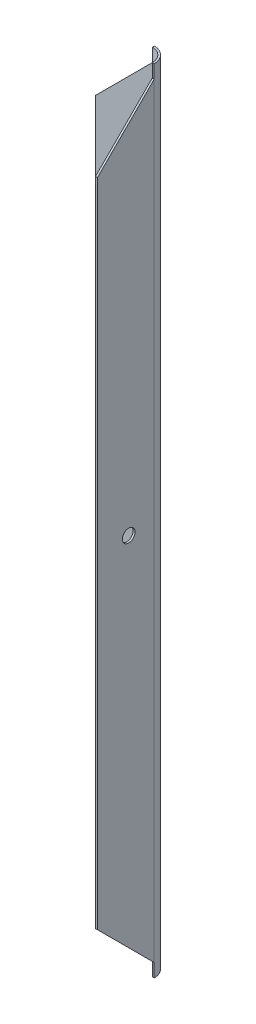
ISO-10303-21;
HEADER;
FILE_DESCRIPTION(('STEP AP214'),'2;1');
FILE_NAME('part.step','',(''),(''),'','','');
FILE_SCHEMA(('AUTOMOTIVE_DESIGN { 1 0 10303 214 1 1 1 1 }'));
ENDSEC;
DATA;
#1=APPLICATION_CONTEXT('core data for automotive mechanical design processes');
#2=APPLICATION_PROTOCOL_DEFINITION('international standard','automotive_design',2000,#1);
#3=PRODUCT_CONTEXT('',#1,'mechanical');
#4=PRODUCT('Part','Part','',(#3));
#5=PRODUCT_RELATED_PRODUCT_CATEGORY('part','',(#4));
#6=PRODUCT_DEFINITION_FORMATION('','',#4);
#7=PRODUCT_DEFINITION_CONTEXT('part definition',#1,'design');
#8=PRODUCT_DEFINITION('design','',#6,#7);
#9=PRODUCT_DEFINITION_SHAPE('','',#8);
#10=(LENGTH_UNIT() NAMED_UNIT(*) SI_UNIT(.MILLI.,.METRE.));
#11=(NAMED_UNIT(*) PLANE_ANGLE_UNIT() SI_UNIT($,.RADIAN.));
#12=(NAMED_UNIT(*) SI_UNIT($,.STERADIAN.) SOLID_ANGLE_UNIT());
#13=UNCERTAINTY_MEASURE_WITH_UNIT(LENGTH_MEASURE(1.E-05),#10,'distance_accuracy_value','');
#14=(GEOMETRIC_REPRESENTATION_CONTEXT(3) GLOBAL_UNCERTAINTY_ASSIGNED_CONTEXT((#13)) GLOBAL_UNIT_ASSIGNED_CONTEXT((#10,
#11,#12)) REPRESENTATION_CONTEXT('',''));
#15=CARTESIAN_POINT('',(0.,0.,0.));
#16=DIRECTION('',(0.,0.,1.));
#17=DIRECTION('',(1.,0.,0.));
#18=AXIS2_PLACEMENT_3D('',#15,#16,#17);
#19=CARTESIAN_POINT('',(0.,310.,-44.5));
#20=DIRECTION('',(0.,0.,-1.));
#21=DIRECTION('',(-1.,0.,0.));
#22=AXIS2_PLACEMENT_3D('',#19,#20,#21);
#23=PLANE('',#22);
#24=DIRECTION('',(1.,0.,0.));
#25=VECTOR('',#24,1.);
#26=CARTESIAN_POINT('',(0.,-299.5,-44.5));
#27=LINE('',#26,#25);
#28=CARTESIAN_POINT('',(0.,-299.5,-44.5000000000001));
#29=VERTEX_POINT('',#28);
#30=CARTESIAN_POINT('',(1.5,-299.5,-44.5));
#31=VERTEX_POINT('',#30);
#32=EDGE_CURVE('E11',#29,#31,#27,.T.);
#33=ORIENTED_EDGE('',*,*,#32,.F.);
#34=DIRECTION('',(0.,-1.,0.));
#35=VECTOR('',#34,1.);
#36=CARTESIAN_POINT('',(0.,310.,-44.5));
#37=LINE('',#36,#35);
#38=CARTESIAN_POINT('',(0.,-310.,-44.5));
#39=VERTEX_POINT('',#38);
#40=EDGE_CURVE('E201',#29,#39,#37,.T.);
#41=ORIENTED_EDGE('',*,*,#40,.T.);
#42=DIRECTION('',(1.,0.,0.));
#43=VECTOR('',#42,1.);
#44=CARTESIAN_POINT('',(0.,-310.,-44.5));
#45=LINE('',#44,#43);
#46=CARTESIAN_POINT('',(1.5,-310.,-44.5));
#47=VERTEX_POINT('',#46);
#48=EDGE_CURVE('E188',#39,#47,#45,.T.);
#49=ORIENTED_EDGE('',*,*,#48,.T.);
#50=DIRECTION('',(0.,-1.,0.));
#51=VECTOR('',#50,1.);
#52=CARTESIAN_POINT('',(1.5,310.,-44.5));
#53=LINE('',#52,#51);
#54=EDGE_CURVE('E205',#31,#47,#53,.T.);
#55=ORIENTED_EDGE('',*,*,#54,.F.);
#56=EDGE_LOOP('',(#33,#41,#49,#55));
#57=FACE_BOUND('',#56,.T.);
#58=ADVANCED_FACE('F43',(#57),#23,.F.);
#59=DIRECTION('',(-1.,0.,0.));
#60=VECTOR('',#59,1.);
#61=CARTESIAN_POINT('',(0.,299.5,-44.5));
#62=LINE('',#61,#60);
#63=CARTESIAN_POINT('',(1.5,299.5,-44.5));
#64=VERTEX_POINT('',#63);
#65=CARTESIAN_POINT('',(0.,299.5,-44.5000000000001));
#66=VERTEX_POINT('',#65);
#67=EDGE_CURVE('E51',#64,#66,#62,.T.);
#68=ORIENTED_EDGE('',*,*,#67,.F.);
#69=CARTESIAN_POINT('',(1.5,310.,-44.5));
#70=VERTEX_POINT('',#69);
#71=EDGE_CURVE('E202',#70,#64,#53,.T.);
#72=ORIENTED_EDGE('',*,*,#71,.F.);
#73=DIRECTION('',(1.,0.,0.));
#74=VECTOR('',#73,1.);
#75=CARTESIAN_POINT('',(0.,310.,-44.5));
#76=LINE('',#75,#74);
#77=CARTESIAN_POINT('',(0.,310.,-44.5));
#78=VERTEX_POINT('',#77);
#79=EDGE_CURVE('E178',#78,#70,#76,.T.);
#80=ORIENTED_EDGE('',*,*,#79,.F.);
#81=EDGE_CURVE('E198',#78,#66,#37,.T.);
#82=ORIENTED_EDGE('',*,*,#81,.T.);
#83=EDGE_LOOP('',(#68,#72,#80,#82));
#84=FACE_BOUND('',#83,.T.);
#85=ADVANCED_FACE('F249',(#84),#23,.F.);
#86=CARTESIAN_POINT('',(-54.9999999999999,255.,-54.9999999999999));
#87=DIRECTION('',(-1.,0.,0.));
#88=DIRECTION('',(0.,-1.,0.));
#89=AXIS2_PLACEMENT_3D('',#86,#87,#88);
#90=PLANE('',#89);
#91=DIRECTION('',(0.,1.,0.));
#92=VECTOR('',#91,1.);
#93=CARTESIAN_POINT('',(-54.9999999999999,255.,-56.4999999999999));
#94=LINE('',#93,#92);
#95=CARTESIAN_POINT('',(-55.,-255.,-56.5));
#96=VERTEX_POINT('',#95);
#97=CARTESIAN_POINT('',(-54.9999999999999,255.,-56.4999999999999));
#98=VERTEX_POINT('',#97);
#99=EDGE_CURVE('E229',#96,#98,#94,.T.);
#100=ORIENTED_EDGE('',*,*,#99,.F.);
#101=DIRECTION('',(0.,0.,-1.));
#102=VECTOR('',#101,1.);
#103=CARTESIAN_POINT('',(-55.,-255.,-55.));
#104=LINE('',#103,#102);
#105=CARTESIAN_POINT('',(-55.,-255.,-55.));
#106=VERTEX_POINT('',#105);
#107=EDGE_CURVE('E227',#106,#96,#104,.T.);
#108=ORIENTED_EDGE('',*,*,#107,.F.);
#109=DIRECTION('',(0.,1.,0.));
#110=VECTOR('',#109,1.);
#111=CARTESIAN_POINT('',(-54.9999999999999,255.,-54.9999999999999));
#112=LINE('',#111,#110);
#113=CARTESIAN_POINT('',(-54.9999999999999,255.,-54.9999999999999));
#114=VERTEX_POINT('',#113);
#115=EDGE_CURVE('E221',#106,#114,#112,.T.);
#116=ORIENTED_EDGE('',*,*,#115,.T.);
#117=DIRECTION('',(0.,0.,-1.));
#118=VECTOR('',#117,1.);
#119=CARTESIAN_POINT('',(-54.9999999999999,255.,-54.9999999999999));
#120=LINE('',#119,#118);
#121=EDGE_CURVE('E234',#114,#98,#120,.T.);
#122=ORIENTED_EDGE('',*,*,#121,.T.);
#123=EDGE_LOOP('',(#100,#108,#116,#122));
#124=FACE_BOUND('',#123,.T.);
#125=ADVANCED_FACE('F269',(#124),#90,.T.);
#126=CARTESIAN_POINT('',(0.,0.,-55.));
#127=DIRECTION('',(0.,0.,1.));
#128=DIRECTION('',(0.,-1.,0.));
#129=AXIS2_PLACEMENT_3D('',#126,#127,#128);
#130=PLANE('',#129);
#131=CARTESIAN_POINT('',(-30.5,0.,-55.));
#132=DIRECTION('',(0.,0.,1.));
#133=DIRECTION('',(0.,-1.,0.));
#134=AXIS2_PLACEMENT_3D('',#131,#132,#133);
#135=CIRCLE('',#134,5.);
#136=CARTESIAN_POINT('',(-30.5,-4.99999999999998,-55.));
#137=VERTEX_POINT('',#136);
#138=EDGE_CURVE('E290',#137,#137,#135,.T.);
#139=ORIENTED_EDGE('',*,*,#138,.F.);
#140=EDGE_LOOP('',(#139));
#141=FACE_BOUND('',#140,.T.);
#142=DIRECTION('',(0.,-1.,0.));
#143=VECTOR('',#142,1.);
#144=CARTESIAN_POINT('',(-10.5,310.,-55.));
#145=LINE('',#144,#143);
#146=CARTESIAN_POINT('',(-10.5,299.5,-55.));
#147=VERTEX_POINT('',#146);
#148=CARTESIAN_POINT('',(-10.5,-299.5,-55.));
#149=VERTEX_POINT('',#148);
#150=EDGE_CURVE('E65',#147,#149,#145,.T.);
#151=ORIENTED_EDGE('',*,*,#150,.F.);
#152=DIRECTION('',(0.707106781186549,0.707106781186546,0.));
#153=VECTOR('',#152,1.);
#154=CARTESIAN_POINT('',(-54.9999999999999,255.,-54.9999999999999));
#155=LINE('',#154,#153);
#156=EDGE_CURVE('E225',#114,#147,#155,.T.);
#157=ORIENTED_EDGE('',*,*,#156,.F.);
#158=ORIENTED_EDGE('',*,*,#115,.F.);
#159=DIRECTION('',(-0.70710678118655,0.707106781186545,0.));
#160=VECTOR('',#159,1.);
#161=CARTESIAN_POINT('',(-55.,-255.,-55.));
#162=LINE('',#161,#160);
#163=EDGE_CURVE('E219',#149,#106,#162,.T.);
#164=ORIENTED_EDGE('',*,*,#163,.F.);
#165=EDGE_LOOP('',(#151,#157,#158,#164));
#166=FACE_BOUND('',#165,.T.);
#167=ADVANCED_FACE('F271',(#141,#166),#130,.T.);
#168=CARTESIAN_POINT('',(-54.9999999999999,255.,-54.9999999999999));
#169=DIRECTION('',(-0.707106781186546,0.707106781186549,0.));
#170=DIRECTION('',(-0.707106781186549,-0.707106781186546,0.));
#171=AXIS2_PLACEMENT_3D('',#168,#169,#170);
#172=PLANE('',#171);
#173=DIRECTION('',(0.,0.,1.));
#174=VECTOR('',#173,1.);
#175=CARTESIAN_POINT('',(-10.5,299.5,-54.9999999999999));
#176=LINE('',#175,#174);
#177=CARTESIAN_POINT('',(-10.5,299.5,-56.5));
#178=VERTEX_POINT('',#177);
#179=EDGE_CURVE('E211',#178,#147,#176,.T.);
#180=ORIENTED_EDGE('',*,*,#179,.F.);
#181=DIRECTION('',(0.707106781186549,0.707106781186546,0.));
#182=VECTOR('',#181,1.);
#183=CARTESIAN_POINT('',(-54.9999999999999,255.,-56.4999999999999));
#184=LINE('',#183,#182);
#185=EDGE_CURVE('E222',#98,#178,#184,.T.);
#186=ORIENTED_EDGE('',*,*,#185,.F.);
#187=ORIENTED_EDGE('',*,*,#121,.F.);
#188=ORIENTED_EDGE('',*,*,#156,.T.);
#189=EDGE_LOOP('',(#180,#186,#187,#188));
#190=FACE_BOUND('',#189,.T.);
#191=ADVANCED_FACE('F259',(#190),#172,.T.);
#192=CARTESIAN_POINT('',(-55.,-255.,-55.));
#193=DIRECTION('',(-0.707106781186545,-0.70710678118655,0.));
#194=DIRECTION('',(0.70710678118655,-0.707106781186545,0.));
#195=AXIS2_PLACEMENT_3D('',#192,#193,#194);
#196=PLANE('',#195);
#197=DIRECTION('',(0.,0.,-1.));
#198=VECTOR('',#197,1.);
#199=CARTESIAN_POINT('',(-10.5,-299.5,-55.));
#200=LINE('',#199,#198);
#201=CARTESIAN_POINT('',(-10.5,-299.5,-56.5));
#202=VERTEX_POINT('',#201);
#203=EDGE_CURVE('E196',#149,#202,#200,.T.);
#204=ORIENTED_EDGE('',*,*,#203,.F.);
#205=ORIENTED_EDGE('',*,*,#163,.T.);
#206=ORIENTED_EDGE('',*,*,#107,.T.);
#207=DIRECTION('',(-0.70710678118655,0.707106781186545,0.));
#208=VECTOR('',#207,1.);
#209=CARTESIAN_POINT('',(-55.,-255.,-56.5));
#210=LINE('',#209,#208);
#211=EDGE_CURVE('E218',#202,#96,#210,.T.);
#212=ORIENTED_EDGE('',*,*,#211,.F.);
#213=EDGE_LOOP('',(#204,#205,#206,#212));
#214=FACE_BOUND('',#213,.T.);
#215=ADVANCED_FACE('F300',(#214),#196,.T.);
#216=CARTESIAN_POINT('',(1.5,0.,-56.5));
#217=DIRECTION('',(0.,0.,-1.));
#218=DIRECTION('',(0.,1.,0.));
#219=AXIS2_PLACEMENT_3D('',#216,#217,#218);
#220=PLANE('',#219);
#221=CARTESIAN_POINT('',(-30.5,0.,-56.5));
#222=DIRECTION('',(0.,0.,-1.));
#223=DIRECTION('',(0.,1.,0.));
#224=AXIS2_PLACEMENT_3D('',#221,#222,#223);
#225=CIRCLE('',#224,5.);
#226=CARTESIAN_POINT('',(-30.5,5.00000000000002,-56.5));
#227=VERTEX_POINT('',#226);
#228=EDGE_CURVE('E293',#227,#227,#225,.T.);
#229=ORIENTED_EDGE('',*,*,#228,.F.);
#230=EDGE_LOOP('',(#229));
#231=FACE_BOUND('',#230,.T.);
#232=ORIENTED_EDGE('',*,*,#185,.T.);
#233=DIRECTION('',(0.,-1.,0.));
#234=VECTOR('',#233,1.);
#235=CARTESIAN_POINT('',(-10.5,310.,-56.5));
#236=LINE('',#235,#234);
#237=EDGE_CURVE('E214',#178,#202,#236,.T.);
#238=ORIENTED_EDGE('',*,*,#237,.T.);
#239=ORIENTED_EDGE('',*,*,#211,.T.);
#240=ORIENTED_EDGE('',*,*,#99,.T.);
#241=EDGE_LOOP('',(#232,#238,#239,#240));
#242=FACE_BOUND('',#241,.T.);
#243=ADVANCED_FACE('F45',(#231,#242),#220,.T.);
#244=CARTESIAN_POINT('',(-10.5,310.,-44.5));
#245=DIRECTION('',(0.,-1.,0.));
#246=DIRECTION('',(0.,0.,-1.));
#247=AXIS2_PLACEMENT_3D('',#244,#245,#246);
#248=CYLINDRICAL_SURFACE('',#247,12.);
#249=DIRECTION('',(0.,-1.,0.));
#250=VECTOR('',#249,1.);
#251=CARTESIAN_POINT('',(1.5,310.,-44.5));
#252=LINE('',#251,#250);
#253=EDGE_CURVE('E165',#64,#31,#252,.T.);
#254=ORIENTED_EDGE('',*,*,#253,.T.);
#255=ORIENTED_EDGE('',*,*,#54,.T.);
#256=CARTESIAN_POINT('',(-10.5,-310.,-44.5));
#257=DIRECTION('',(0.,-1.,0.));
#258=DIRECTION('',(0.,0.,-1.));
#259=AXIS2_PLACEMENT_3D('',#256,#257,#258);
#260=CIRCLE('',#259,12.);
#261=CARTESIAN_POINT('',(-10.5,-310.,-56.5));
#262=VERTEX_POINT('',#261);
#263=EDGE_CURVE('E185',#262,#47,#260,.T.);
#264=ORIENTED_EDGE('',*,*,#263,.F.);
#265=DIRECTION('',(0.,-1.,0.));
#266=VECTOR('',#265,1.);
#267=CARTESIAN_POINT('',(-10.5,310.,-56.5));
#268=LINE('',#267,#266);
#269=EDGE_CURVE('E182',#202,#262,#268,.T.);
#270=ORIENTED_EDGE('',*,*,#269,.F.);
#271=ORIENTED_EDGE('',*,*,#237,.F.);
#272=CARTESIAN_POINT('',(-10.5,310.,-56.5));
#273=VERTEX_POINT('',#272);
#274=EDGE_CURVE('E206',#273,#178,#268,.T.);
#275=ORIENTED_EDGE('',*,*,#274,.F.);
#276=CARTESIAN_POINT('',(-10.5,310.,-44.5));
#277=DIRECTION('',(0.,-1.,0.));
#278=DIRECTION('',(0.,0.,-1.));
#279=AXIS2_PLACEMENT_3D('',#276,#277,#278);
#280=CIRCLE('',#279,12.);
#281=EDGE_CURVE('E174',#273,#70,#280,.T.);
#282=ORIENTED_EDGE('',*,*,#281,.T.);
#283=ORIENTED_EDGE('',*,*,#71,.T.);
#284=EDGE_LOOP('',(#254,#255,#264,#270,#271,#275,#282,#283));
#285=FACE_BOUND('',#284,.T.);
#286=ADVANCED_FACE('F262',(#285),#248,.T.);
#287=CARTESIAN_POINT('',(-10.5,310.,0.));
#288=DIRECTION('',(-1.,0.,0.));
#289=DIRECTION('',(0.,0.,1.));
#290=AXIS2_PLACEMENT_3D('',#287,#288,#289);
#291=PLANE('',#290);
#292=ORIENTED_EDGE('',*,*,#274,.T.);
#293=ORIENTED_EDGE('',*,*,#179,.T.);
#294=CARTESIAN_POINT('',(-10.5,310.,-55.));
#295=VERTEX_POINT('',#294);
#296=EDGE_CURVE('E193',#295,#147,#145,.T.);
#297=ORIENTED_EDGE('',*,*,#296,.F.);
#298=DIRECTION('',(0.,0.,-1.));
#299=VECTOR('',#298,1.);
#300=CARTESIAN_POINT('',(-10.5,310.,0.));
#301=LINE('',#300,#299);
#302=EDGE_CURVE('E171',#295,#273,#301,.T.);
#303=ORIENTED_EDGE('',*,*,#302,.T.);
#304=EDGE_LOOP('',(#292,#293,#297,#303));
#305=FACE_BOUND('',#304,.T.);
#306=ADVANCED_FACE('F255',(#305),#291,.T.);
#307=CARTESIAN_POINT('',(-10.5,-310.,-55.));
#308=VERTEX_POINT('',#307);
#309=EDGE_CURVE('E197',#149,#308,#145,.T.);
#310=ORIENTED_EDGE('',*,*,#309,.F.);
#311=ORIENTED_EDGE('',*,*,#203,.T.);
#312=ORIENTED_EDGE('',*,*,#269,.T.);
#313=DIRECTION('',(0.,0.,-1.));
#314=VECTOR('',#313,1.);
#315=CARTESIAN_POINT('',(-10.5,-310.,0.));
#316=LINE('',#315,#314);
#317=EDGE_CURVE('E168',#308,#262,#316,.T.);
#318=ORIENTED_EDGE('',*,*,#317,.F.);
#319=EDGE_LOOP('',(#310,#311,#312,#318));
#320=FACE_BOUND('',#319,.T.);
#321=ADVANCED_FACE('F276',(#320),#291,.T.);
#322=CARTESIAN_POINT('',(-10.5,310.,-44.5));
#323=DIRECTION('',(0.,-1.,0.));
#324=DIRECTION('',(0.,0.,-1.));
#325=AXIS2_PLACEMENT_3D('',#322,#323,#324);
#326=CYLINDRICAL_SURFACE('',#325,10.5);
#327=CARTESIAN_POINT('',(-10.5,-310.,-44.5));
#328=DIRECTION('',(0.,-1.,0.));
#329=DIRECTION('',(0.,0.,-1.));
#330=AXIS2_PLACEMENT_3D('',#327,#328,#329);
#331=CIRCLE('',#330,10.5);
#332=EDGE_CURVE('E175',#308,#39,#331,.T.);
#333=ORIENTED_EDGE('',*,*,#332,.T.);
#334=ORIENTED_EDGE('',*,*,#40,.F.);
#335=EDGE_CURVE('E149',#66,#29,#37,.T.);
#336=ORIENTED_EDGE('',*,*,#335,.F.);
#337=ORIENTED_EDGE('',*,*,#81,.F.);
#338=CARTESIAN_POINT('',(-10.5,310.,-44.5));
#339=DIRECTION('',(0.,-1.,0.));
#340=DIRECTION('',(0.,0.,-1.));
#341=AXIS2_PLACEMENT_3D('',#338,#339,#340);
#342=CIRCLE('',#341,10.5);
#343=EDGE_CURVE('E180',#295,#78,#342,.T.);
#344=ORIENTED_EDGE('',*,*,#343,.F.);
#345=ORIENTED_EDGE('',*,*,#296,.T.);
#346=ORIENTED_EDGE('',*,*,#150,.T.);
#347=ORIENTED_EDGE('',*,*,#309,.T.);
#348=EDGE_LOOP('',(#333,#334,#336,#337,#344,#345,#346,#347));
#349=FACE_BOUND('',#348,.T.);
#350=ADVANCED_FACE('F246',(#349),#326,.F.);
#351=CARTESIAN_POINT('',(0.,310.,0.));
#352=DIRECTION('',(0.,-1.,0.));
#353=DIRECTION('',(0.,0.,-1.));
#354=AXIS2_PLACEMENT_3D('',#351,#352,#353);
#355=PLANE('',#354);
#356=ORIENTED_EDGE('',*,*,#302,.F.);
#357=ORIENTED_EDGE('',*,*,#343,.T.);
#358=ORIENTED_EDGE('',*,*,#79,.T.);
#359=ORIENTED_EDGE('',*,*,#281,.F.);
#360=EDGE_LOOP('',(#356,#357,#358,#359));
#361=FACE_BOUND('',#360,.T.);
#362=ADVANCED_FACE('F253',(#361),#355,.F.);
#363=CARTESIAN_POINT('',(0.,-310.,0.));
#364=DIRECTION('',(0.,-1.,0.));
#365=DIRECTION('',(0.,0.,-1.));
#366=AXIS2_PLACEMENT_3D('',#363,#364,#365);
#367=PLANE('',#366);
#368=ORIENTED_EDGE('',*,*,#317,.T.);
#369=ORIENTED_EDGE('',*,*,#263,.T.);
#370=ORIENTED_EDGE('',*,*,#48,.F.);
#371=ORIENTED_EDGE('',*,*,#332,.F.);
#372=EDGE_LOOP('',(#368,#369,#370,#371));
#373=FACE_BOUND('',#372,.T.);
#374=ADVANCED_FACE('F280',(#373),#367,.T.);
#375=CARTESIAN_POINT('',(1.5,-127.500000000002,127.5));
#376=DIRECTION('',(0.,0.707106781186551,-0.707106781186544));
#377=DIRECTION('',(0.,0.707106781186544,0.707106781186551));
#378=AXIS2_PLACEMENT_3D('',#375,#376,#377);
#379=PLANE('',#378);
#380=DIRECTION('',(0.,-0.707106781186544,-0.707106781186551));
#381=VECTOR('',#380,1.);
#382=CARTESIAN_POINT('',(0.,-127.500000000002,127.5));
#383=LINE('',#382,#381);
#384=CARTESIAN_POINT('',(0.,-255.000000000001,0.));
#385=VERTEX_POINT('',#384);
#386=EDGE_CURVE('E136',#385,#29,#383,.T.);
#387=ORIENTED_EDGE('',*,*,#386,.T.);
#388=ORIENTED_EDGE('',*,*,#32,.T.);
#389=DIRECTION('',(0.,-0.707106781186544,-0.707106781186551));
#390=VECTOR('',#389,1.);
#391=CARTESIAN_POINT('',(1.5,-127.500000000002,127.5));
#392=LINE('',#391,#390);
#393=CARTESIAN_POINT('',(1.5,-255.000000000001,0.));
#394=VERTEX_POINT('',#393);
#395=EDGE_CURVE('E58',#394,#31,#392,.T.);
#396=ORIENTED_EDGE('',*,*,#395,.F.);
#397=DIRECTION('',(-1.,0.,0.));
#398=VECTOR('',#397,1.);
#399=CARTESIAN_POINT('',(1.5,-255.000000000001,0.));
#400=LINE('',#399,#398);
#401=EDGE_CURVE('E133',#394,#385,#400,.T.);
#402=ORIENTED_EDGE('',*,*,#401,.T.);
#403=EDGE_LOOP('',(#387,#388,#396,#402));
#404=FACE_BOUND('',#403,.T.);
#405=ADVANCED_FACE('F135',(#404),#379,.F.);
#406=CARTESIAN_POINT('',(1.5,127.500000000001,127.5));
#407=DIRECTION('',(0.,-0.70710678118655,-0.707106781186544));
#408=DIRECTION('',(0.,0.707106781186545,-0.70710678118655));
#409=AXIS2_PLACEMENT_3D('',#406,#407,#408);
#410=PLANE('',#409);
#411=DIRECTION('',(0.,-0.707106781186545,0.70710678118655));
#412=VECTOR('',#411,1.);
#413=CARTESIAN_POINT('',(1.5,127.500000000001,127.5));
#414=LINE('',#413,#412);
#415=CARTESIAN_POINT('',(1.5,255.000000000001,0.));
#416=VERTEX_POINT('',#415);
#417=EDGE_CURVE('E162',#64,#416,#414,.T.);
#418=ORIENTED_EDGE('',*,*,#417,.F.);
#419=ORIENTED_EDGE('',*,*,#67,.T.);
#420=DIRECTION('',(0.,-0.707106781186545,0.70710678118655));
#421=VECTOR('',#420,1.);
#422=CARTESIAN_POINT('',(0.,127.500000000001,127.5));
#423=LINE('',#422,#421);
#424=CARTESIAN_POINT('',(0.,255.000000000001,0.));
#425=VERTEX_POINT('',#424);
#426=EDGE_CURVE('E150',#66,#425,#423,.T.);
#427=ORIENTED_EDGE('',*,*,#426,.T.);
#428=DIRECTION('',(-1.,0.,0.));
#429=VECTOR('',#428,1.);
#430=CARTESIAN_POINT('',(1.5,255.000000000001,0.));
#431=LINE('',#430,#429);
#432=EDGE_CURVE('E155',#416,#425,#431,.T.);
#433=ORIENTED_EDGE('',*,*,#432,.F.);
#434=EDGE_LOOP('',(#418,#419,#427,#433));
#435=FACE_BOUND('',#434,.T.);
#436=ADVANCED_FACE('F240',(#435),#410,.F.);
#437=CARTESIAN_POINT('',(0.,0.,0.));
#438=DIRECTION('',(1.,0.,0.));
#439=DIRECTION('',(0.,0.,-1.));
#440=AXIS2_PLACEMENT_3D('',#437,#438,#439);
#441=PLANE('',#440);
#442=CARTESIAN_POINT('',(0.,1.66533453693773E-13,-24.5));
#443=DIRECTION('',(1.,0.,0.));
#444=DIRECTION('',(0.,0.,-1.));
#445=AXIS2_PLACEMENT_3D('',#442,#443,#444);
#446=CIRCLE('',#445,4.99999999999999);
#447=CARTESIAN_POINT('',(0.,1.66533453693773E-13,-29.5));
#448=VERTEX_POINT('',#447);
#449=EDGE_CURVE('E141',#448,#448,#446,.T.);
#450=ORIENTED_EDGE('',*,*,#449,.T.);
#451=EDGE_LOOP('',(#450));
#452=FACE_BOUND('',#451,.T.);
#453=ORIENTED_EDGE('',*,*,#426,.F.);
#454=ORIENTED_EDGE('',*,*,#335,.T.);
#455=ORIENTED_EDGE('',*,*,#386,.F.);
#456=DIRECTION('',(0.,1.,0.));
#457=VECTOR('',#456,1.);
#458=CARTESIAN_POINT('',(0.,0.,0.));
#459=LINE('',#458,#457);
#460=EDGE_CURVE('E147',#385,#425,#459,.T.);
#461=ORIENTED_EDGE('',*,*,#460,.T.);
#462=EDGE_LOOP('',(#453,#454,#455,#461));
#463=FACE_BOUND('',#462,.T.);
#464=ADVANCED_FACE('F146',(#452,#463),#441,.F.);
#465=CARTESIAN_POINT('',(1.5,0.,0.));
#466=DIRECTION('',(0.,0.,1.));
#467=DIRECTION('',(0.,-1.,0.));
#468=AXIS2_PLACEMENT_3D('',#465,#466,#467);
#469=PLANE('',#468);
#470=ORIENTED_EDGE('',*,*,#460,.F.);
#471=ORIENTED_EDGE('',*,*,#401,.F.);
#472=DIRECTION('',(0.,1.,0.));
#473=VECTOR('',#472,1.);
#474=CARTESIAN_POINT('',(1.5,0.,0.));
#475=LINE('',#474,#473);
#476=EDGE_CURVE('E156',#394,#416,#475,.T.);
#477=ORIENTED_EDGE('',*,*,#476,.T.);
#478=ORIENTED_EDGE('',*,*,#432,.T.);
#479=EDGE_LOOP('',(#470,#471,#477,#478));
#480=FACE_BOUND('',#479,.T.);
#481=ADVANCED_FACE('F153',(#480),#469,.T.);
#482=CARTESIAN_POINT('',(1.5,0.,0.));
#483=DIRECTION('',(1.,0.,0.));
#484=DIRECTION('',(0.,0.,-1.));
#485=AXIS2_PLACEMENT_3D('',#482,#483,#484);
#486=PLANE('',#485);
#487=CARTESIAN_POINT('',(1.5,1.66533453693773E-13,-24.5));
#488=DIRECTION('',(1.,0.,0.));
#489=DIRECTION('',(0.,0.,-1.));
#490=AXIS2_PLACEMENT_3D('',#487,#488,#489);
#491=CIRCLE('',#490,4.99999999999999);
#492=CARTESIAN_POINT('',(1.5,1.66533453693773E-13,-29.5));
#493=VERTEX_POINT('',#492);
#494=EDGE_CURVE('E287',#493,#493,#491,.T.);
#495=ORIENTED_EDGE('',*,*,#494,.F.);
#496=EDGE_LOOP('',(#495));
#497=FACE_BOUND('',#496,.T.);
#498=ORIENTED_EDGE('',*,*,#253,.F.);
#499=ORIENTED_EDGE('',*,*,#417,.T.);
#500=ORIENTED_EDGE('',*,*,#476,.F.);
#501=ORIENTED_EDGE('',*,*,#395,.T.);
#502=EDGE_LOOP('',(#498,#499,#500,#501));
#503=FACE_BOUND('',#502,.T.);
#504=ADVANCED_FACE('F283',(#497,#503),#486,.T.);
#505=CARTESIAN_POINT('',(-55.,1.66533453693773E-13,-24.5));
#506=DIRECTION('',(1.,0.,0.));
#507=DIRECTION('',(0.,0.,-1.));
#508=AXIS2_PLACEMENT_3D('',#505,#506,#507);
#509=CYLINDRICAL_SURFACE('',#508,4.99999999999999);
#510=ORIENTED_EDGE('',*,*,#494,.T.);
#511=EDGE_LOOP('',(#510));
#512=FACE_BOUND('',#511,.T.);
#513=ORIENTED_EDGE('',*,*,#449,.F.);
#514=EDGE_LOOP('',(#513));
#515=FACE_BOUND('',#514,.T.);
#516=ADVANCED_FACE('F431',(#512,#515),#509,.F.);
#517=CARTESIAN_POINT('',(-30.5,0.,1.94289029309402E-13));
#518=DIRECTION('',(0.,0.,-1.));
#519=DIRECTION('',(0.,1.,0.));
#520=AXIS2_PLACEMENT_3D('',#517,#518,#519);
#521=CYLINDRICAL_SURFACE('',#520,5.);
#522=ORIENTED_EDGE('',*,*,#138,.T.);
#523=EDGE_LOOP('',(#522));
#524=FACE_BOUND('',#523,.T.);
#525=ORIENTED_EDGE('',*,*,#228,.T.);
#526=EDGE_LOOP('',(#525));
#527=FACE_BOUND('',#526,.T.);
#528=ADVANCED_FACE('F297',(#524,#527),#521,.F.);
#529=CLOSED_SHELL('',(#58,#85,#125,#167,#191,#215,#243,#286,#306,#321,#350,#362,#374,#405,#436,
#464,#481,#504,#516,#528));
#530=MANIFOLD_SOLID_BREP('B2',#529);
#531=ADVANCED_BREP_SHAPE_REPRESENTATION('',(#18,#530),#14);
#532=SHAPE_DEFINITION_REPRESENTATION(#9,#531);
ENDSEC;
END-ISO-10303-21;
